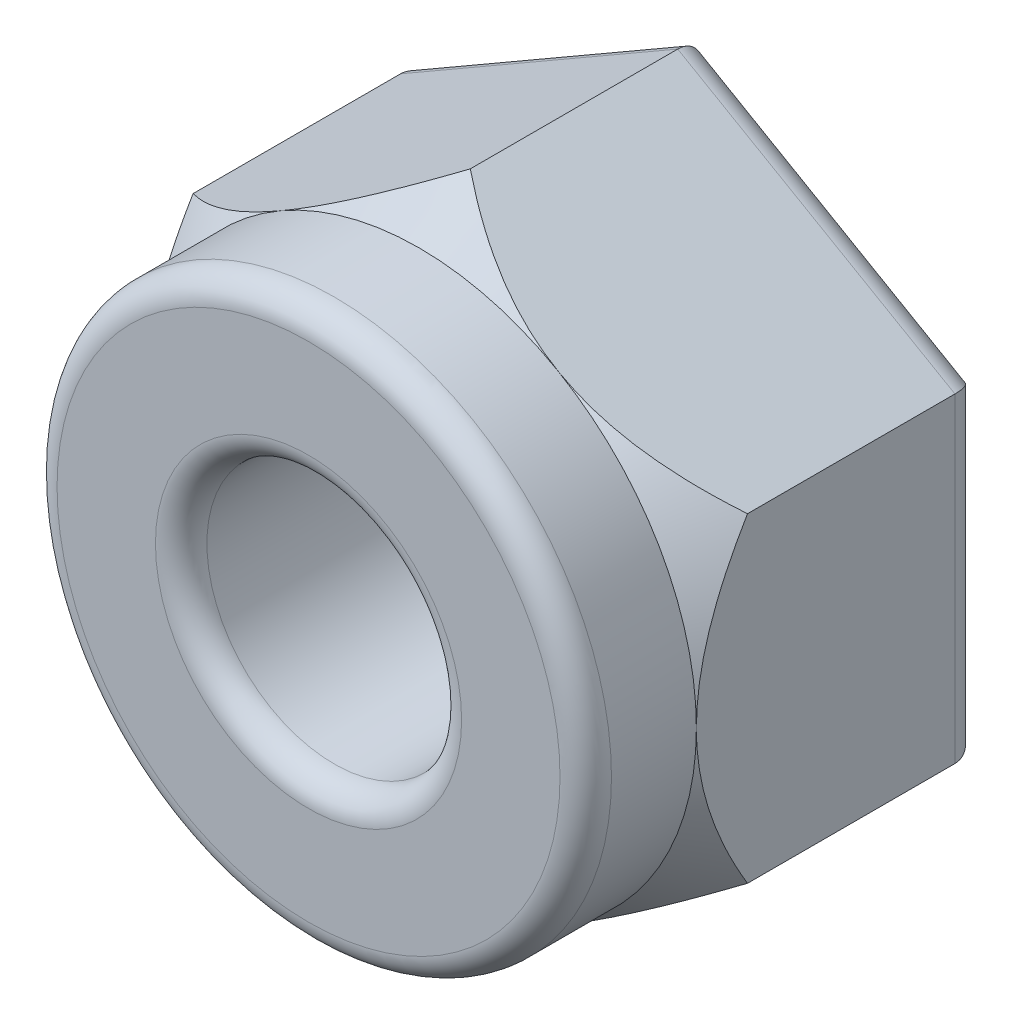
ISO-10303-21;
HEADER;
FILE_DESCRIPTION(('STEP AP214'),'2;1');
FILE_NAME('part.step','',(''),(''),'','','');
FILE_SCHEMA(('AUTOMOTIVE_DESIGN { 1 0 10303 214 1 1 1 1 }'));
ENDSEC;
DATA;
#1=APPLICATION_CONTEXT('core data for automotive mechanical design processes');
#2=APPLICATION_PROTOCOL_DEFINITION('international standard','automotive_design',2000,#1);
#3=PRODUCT_CONTEXT('',#1,'mechanical');
#4=PRODUCT('Part','Part','',(#3));
#5=PRODUCT_RELATED_PRODUCT_CATEGORY('part','',(#4));
#6=PRODUCT_DEFINITION_FORMATION('','',#4);
#7=PRODUCT_DEFINITION_CONTEXT('part definition',#1,'design');
#8=PRODUCT_DEFINITION('design','',#6,#7);
#9=PRODUCT_DEFINITION_SHAPE('','',#8);
#10=(LENGTH_UNIT() NAMED_UNIT(*) SI_UNIT(.MILLI.,.METRE.));
#11=(NAMED_UNIT(*) PLANE_ANGLE_UNIT() SI_UNIT($,.RADIAN.));
#12=(NAMED_UNIT(*) SI_UNIT($,.STERADIAN.) SOLID_ANGLE_UNIT());
#13=UNCERTAINTY_MEASURE_WITH_UNIT(LENGTH_MEASURE(1.E-05),#10,'distance_accuracy_value','');
#14=(GEOMETRIC_REPRESENTATION_CONTEXT(3) GLOBAL_UNCERTAINTY_ASSIGNED_CONTEXT((#13)) GLOBAL_UNIT_ASSIGNED_CONTEXT((#10,
#11,#12)) REPRESENTATION_CONTEXT('',''));
#15=CARTESIAN_POINT('',(0.,0.,0.));
#16=DIRECTION('',(0.,0.,1.));
#17=DIRECTION('',(1.,0.,0.));
#18=AXIS2_PLACEMENT_3D('',#15,#16,#17);
#19=CARTESIAN_POINT('',(0.,0.,7.7978));
#20=DIRECTION('',(0.,0.,-1.));
#21=DIRECTION('',(-1.,0.,0.));
#22=AXIS2_PLACEMENT_3D('',#19,#20,#21);
#23=CYLINDRICAL_SURFACE('',#22,5.473573);
#24=CARTESIAN_POINT('',(0.,0.,5.61340000007249));
#25=DIRECTION('',(0.,0.,-1.));
#26=DIRECTION('',(-1.,0.,0.));
#27=AXIS2_PLACEMENT_3D('',#24,#25,#26);
#28=CIRCLE('',#27,5.47357300007434);
#29=CARTESIAN_POINT('',(5.47363650003845,0.,5.61332432368251));
#30=VERTEX_POINT('',#29);
#31=CARTESIAN_POINT('',(-5.47363650003845,0.,5.61332432368251));
#32=VERTEX_POINT('',#31);
#33=EDGE_CURVE('E99',#30,#32,#28,.T.);
#34=ORIENTED_EDGE('',*,*,#33,.F.);
#35=CARTESIAN_POINT('',(0.,0.,5.61340000007249));
#36=DIRECTION('',(0.,0.,-1.));
#37=DIRECTION('',(-1.,0.,0.));
#38=AXIS2_PLACEMENT_3D('',#35,#36,#37);
#39=CIRCLE('',#38,5.47357300007434);
#40=EDGE_CURVE('E109',#32,#30,#39,.T.);
#41=ORIENTED_EDGE('',*,*,#40,.F.);
#42=EDGE_LOOP('',(#34,#41));
#43=FACE_BOUND('',#42,.T.);
#44=CARTESIAN_POINT('',(0.,0.,7.2898));
#45=DIRECTION('',(0.,0.,1.));
#46=DIRECTION('',(1.,0.,0.));
#47=AXIS2_PLACEMENT_3D('',#44,#45,#46);
#48=CIRCLE('',#47,5.473573);
#49=CARTESIAN_POINT('',(5.473573,0.,7.2898));
#50=VERTEX_POINT('',#49);
#51=EDGE_CURVE('E123',#50,#50,#48,.T.);
#52=ORIENTED_EDGE('',*,*,#51,.F.);
#53=EDGE_LOOP('',(#52));
#54=FACE_BOUND('',#53,.T.);
#55=ADVANCED_FACE('F18',(#43,#54),#23,.T.);
#56=CARTESIAN_POINT('',(0.,0.,7.2898));
#57=DIRECTION('',(0.,0.,1.));
#58=DIRECTION('',(1.,0.,0.));
#59=AXIS2_PLACEMENT_3D('',#56,#57,#58);
#60=TOROIDAL_SURFACE('',#59,4.965573,0.508);
#61=ORIENTED_EDGE('',*,*,#51,.T.);
#62=EDGE_LOOP('',(#61));
#63=FACE_BOUND('',#62,.T.);
#64=CARTESIAN_POINT('',(0.,0.,7.7978));
#65=DIRECTION('',(0.,0.,-1.));
#66=DIRECTION('',(1.,0.,0.));
#67=AXIS2_PLACEMENT_3D('',#64,#65,#66);
#68=CIRCLE('',#67,4.965573);
#69=CARTESIAN_POINT('',(-4.965573,0.,7.7978));
#70=VERTEX_POINT('',#69);
#71=CARTESIAN_POINT('',(4.965573,0.,7.7978));
#72=VERTEX_POINT('',#71);
#73=EDGE_CURVE('E279',#70,#72,#68,.F.);
#74=ORIENTED_EDGE('',*,*,#73,.F.);
#75=CARTESIAN_POINT('',(0.,0.,7.7978));
#76=DIRECTION('',(0.,0.,-1.));
#77=DIRECTION('',(-1.,0.,0.));
#78=AXIS2_PLACEMENT_3D('',#75,#76,#77);
#79=CIRCLE('',#78,4.965573);
#80=EDGE_CURVE('E120',#72,#70,#79,.F.);
#81=ORIENTED_EDGE('',*,*,#80,.F.);
#82=EDGE_LOOP('',(#74,#81));
#83=FACE_BOUND('',#82,.T.);
#84=ADVANCED_FACE('F162',(#63,#83),#60,.T.);
#85=CARTESIAN_POINT('',(0.,0.,4.59802658468789));
#86=DIRECTION('',(0.,0.,-1.));
#87=DIRECTION('',(-1.,0.,0.));
#88=AXIS2_PLACEMENT_3D('',#85,#86,#87);
#89=CONICAL_SURFACE('',#88,6.32557245836551,0.698131700784267);
#90=CARTESIAN_POINT('',(-3.44800650208801E-11,-6.32048433693605,4.6040903716672));
#91=CARTESIAN_POINT('',(0.0806468241206535,-6.27392287130734,4.65957169652409));
#92=CARTESIAN_POINT('',(0.161986378858017,-6.22696145748673,4.71370747096505));
#93=CARTESIAN_POINT('',(0.326198917475653,-6.13215330411363,4.81888767586166));
#94=CARTESIAN_POINT('',(0.40907260806246,-6.08430615654391,4.86993063287893));
#95=CARTESIAN_POINT('',(0.661110506350095,-5.93879200812046,5.0183362333634));
#96=CARTESIAN_POINT('',(0.832721574396692,-5.83971231178837,5.11029587753059));
#97=CARTESIAN_POINT('',(1.18325350039445,-5.6373326099544,5.27559122535804));
#98=CARTESIAN_POINT('',(1.36219491409555,-5.53402073658476,5.34886970733963));
#99=CARTESIAN_POINT('',(1.72592509487001,-5.32402101880213,5.47094506460906));
#100=CARTESIAN_POINT('',(1.91069662641023,-5.21734312532885,5.51980801191535));
#101=CARTESIAN_POINT('',(2.21651771158293,-5.04077723948054,5.57608542568136));
#102=CARTESIAN_POINT('',(2.33640110152782,-4.97156253202449,5.59210280181984));
#103=CARTESIAN_POINT('',(2.57697337158379,-4.83266806714811,5.61162851562283));
#104=CARTESIAN_POINT('',(2.69766238579003,-4.76298823230791,5.61513471603463));
#105=CARTESIAN_POINT('',(2.93815772938183,-4.62413818094633,5.60945527299954));
#106=CARTESIAN_POINT('',(3.05796530288268,-4.55496724613466,5.60033815603546));
#107=CARTESIAN_POINT('',(3.29640952776834,-4.41730140871021,5.56999209651926));
#108=CARTESIAN_POINT('',(3.41504612036376,-4.34880654003951,5.54876254897435));
#109=CARTESIAN_POINT('',(3.68316808018463,-4.19400625436128,5.48766703768943));
#110=CARTESIAN_POINT('',(3.83204787420965,-4.10805046520403,5.44425836539469));
#111=CARTESIAN_POINT('',(4.12572900443689,-3.93849358561143,5.34184078267169));
#112=CARTESIAN_POINT('',(4.27052806293275,-3.85489381021044,5.28282334367392));
#113=CARTESIAN_POINT('',(4.55624450695215,-3.68993534434394,5.15174656223514));
#114=CARTESIAN_POINT('',(4.69714394551453,-3.60858701556128,5.07963573854967));
#115=CARTESIAN_POINT('',(4.97453415362734,-3.44843570423678,4.92508691349547));
#116=CARTESIAN_POINT('',(5.1110263926622,-3.36963187328771,4.8426524000094));
#117=CARTESIAN_POINT('',(5.28390521141959,-3.26982024074095,4.73137215433213));
#118=CARTESIAN_POINT('',(5.32215338922578,-3.24773764498853,4.70630954535836));
#119=CARTESIAN_POINT('',(5.3982173986128,-3.20382206869329,4.65562586773433));
#120=CARTESIAN_POINT('',(5.4360341871267,-3.1819885356649,4.63000671451711));
#121=CARTESIAN_POINT('',(5.4737000000317,-3.16024216844496,4.60409037167073));
#122=B_SPLINE_CURVE_WITH_KNOTS('',3,(#90,#91,#92,#93,#94,#95,#96,#97,#98,#99,#100,#101,#102,
#103,#104,#105,#106,#107,#108,#109,#110,#111,#112,#113,#114,#115,#116,#117,#118,#119,#120,#121),
.UNSPECIFIED.,.F.,.F.,(4,2,2,2,2,2,2,2,2,2,2,2,2,2,2,4),(0.,0.32517094607764,0.650495607051777,
1.30506699828014,1.96161992758931,2.61638637340977,3.03393759262822,3.45156013765875,
3.86692445933383,4.28230952948092,4.81332314682153,5.34462750952096,5.87806799216359,
6.41132873445067,6.56366901387112,6.71554916045058),.UNSPECIFIED.);
#123=CARTESIAN_POINT('',(0.,-6.32048433694486,4.60409037167067));
#124=VERTEX_POINT('',#123);
#125=CARTESIAN_POINT('',(5.47370000001589,-3.16024216847243,4.60409037167067));
#126=VERTEX_POINT('',#125);
#127=EDGE_CURVE('E134',#124,#126,#122,.T.);
#128=ORIENTED_EDGE('',*,*,#127,.T.);
#129=CARTESIAN_POINT('',(5.47369999999103,-3.16024216849789,4.6040903716672));
#130=CARTESIAN_POINT('',(5.47369999999669,-3.06538820904934,4.66060246537327));
#131=CARTESIAN_POINT('',(5.47369999999909,-2.96970533686749,4.7157187156211));
#132=CARTESIAN_POINT('',(5.47370000000091,-2.7764965972506,4.82273768194899));
#133=CARTESIAN_POINT('',(5.47370000000032,-2.67896979302794,4.87463870401429));
#134=CARTESIAN_POINT('',(5.47369999999936,-2.38223854228141,5.02543743550952));
#135=CARTESIAN_POINT('',(5.47369999999983,-2.18009070238363,5.11869746994602));
#136=CARTESIAN_POINT('',(5.47370000000016,-1.77466064962528,5.28259710176229));
#137=CARTESIAN_POINT('',(5.47370000000004,-1.57164857729977,5.35389566962388));
#138=CARTESIAN_POINT('',(5.47369999999996,-1.15924602750321,5.47279373517426));
#139=CARTESIAN_POINT('',(5.47369999999999,-0.949877560536965,5.52046688631316));
#140=CARTESIAN_POINT('',(5.47370000000001,-0.616861951884045,5.57352537285922));
#141=CARTESIAN_POINT('',(5.4737,-0.494672423131132,5.58827341377343));
#142=CARTESIAN_POINT('',(5.4737,-0.248346070156859,5.60820858488308));
#143=CARTESIAN_POINT('',(5.4737,-0.124201793420817,5.61330305908261));
#144=CARTESIAN_POINT('',(5.4737,0.,5.61324864740481));
#145=B_SPLINE_CURVE_WITH_KNOTS('',3,(#129,#130,#131,#132,#133,#134,#135,#136,#137,#138,#139,
#140,#141,#142,#143,#144),.UNSPECIFIED.,.F.,.F.,(4,2,2,2,2,2,2,4),(0.,0.331212119006668,
0.662597285821446,1.32959639940192,1.97401235167945,2.61640646348871,2.98528256004872,
3.35768158224868),.UNSPECIFIED.);
#146=EDGE_CURVE('E128',#126,#30,#145,.T.);
#147=ORIENTED_EDGE('',*,*,#146,.T.);
#148=ORIENTED_EDGE('',*,*,#33,.T.);
#149=CARTESIAN_POINT('',(-5.4737,0.,5.61324864740481));
#150=CARTESIAN_POINT('',(-5.4737,-0.0715756577425598,5.61325372616311));
#151=CARTESIAN_POINT('',(-5.4737,-0.143140391499476,5.61157473093531));
#152=CARTESIAN_POINT('',(-5.4737,-0.286104737437581,5.60489744786615));
#153=CARTESIAN_POINT('',(-5.4737,-0.357504372113359,5.59989964265952));
#154=CARTESIAN_POINT('',(-5.4737,-0.570990036034535,5.58002678017663));
#155=CARTESIAN_POINT('',(-5.4737,-0.712647081285898,5.5602718859225));
#156=CARTESIAN_POINT('',(-5.4737,-0.991189854919164,5.50915500612715));
#157=CARTESIAN_POINT('',(-5.4737,-1.12811562886177,5.47800594297026));
#158=CARTESIAN_POINT('',(-5.4737,-1.39921221294859,5.40533316321875));
#159=CARTESIAN_POINT('',(-5.4737,-1.53338204703063,5.36380583728373));
#160=CARTESIAN_POINT('',(-5.4737,-1.79540860286679,5.27288343635352));
#161=CARTESIAN_POINT('',(-5.4737,-1.92333956982938,5.22370002426318));
#162=CARTESIAN_POINT('',(-5.4737,-2.17615622936337,5.11803896903137));
#163=CARTESIAN_POINT('',(-5.4737,-2.3010414261266,5.06156014759897));
#164=CARTESIAN_POINT('',(-5.4737,-2.55009716634746,4.94136191805613));
#165=CARTESIAN_POINT('',(-5.4737,-2.67421211736171,4.87752824760918));
#166=CARTESIAN_POINT('',(-5.4737,-2.91941495123158,4.74455138277509));
#167=CARTESIAN_POINT('',(-5.4737,-3.04050568272448,4.67541345558568));
#168=CARTESIAN_POINT('',(-5.4737,-3.16024216849924,4.6040903716711));
#169=B_SPLINE_CURVE_WITH_KNOTS('',3,(#149,#150,#151,#152,#153,#154,#155,#156,#157,#158,#159,
#160,#161,#162,#163,#164,#165,#166,#167,#168),.UNSPECIFIED.,.F.,.F.,(4,2,2,2,2,2,2,2,2,4),(0.,
0.214686292298542,0.429341370886519,0.857802067618737,1.2786341794342,1.69961285192831,
2.11053428403396,2.52152216776784,2.94008473325169,3.35823691037953),.UNSPECIFIED.);
#170=CARTESIAN_POINT('',(-5.47370000001589,-3.16024216847243,4.60409037167067));
#171=VERTEX_POINT('',#170);
#172=EDGE_CURVE('E182',#32,#171,#169,.T.);
#173=ORIENTED_EDGE('',*,*,#172,.T.);
#174=CARTESIAN_POINT('',(-5.47370000002551,-3.16024216843816,4.6040903716672));
#175=CARTESIAN_POINT('',(-5.39305317587604,-3.20680363407669,4.65957169652409));
#176=CARTESIAN_POINT('',(-5.31171362114108,-3.25376504790146,4.71370747096505));
#177=CARTESIAN_POINT('',(-5.14750108252526,-3.34857320127771,4.81888767586166));
#178=CARTESIAN_POINT('',(-5.06462739193786,-3.3964203488464,4.86993063287893));
#179=CARTESIAN_POINT('',(-4.81258949364927,-3.5419344972682,5.0183362333634));
#180=CARTESIAN_POINT('',(-4.64097842560314,-3.64101419360109,5.11029587753059));
#181=CARTESIAN_POINT('',(-4.29044649960572,-3.84339389543566,5.27559122535804));
#182=CARTESIAN_POINT('',(-4.1115050859045,-3.94670576880508,5.34886970733963));
#183=CARTESIAN_POINT('',(-3.74777490512995,-4.15670548658756,5.47094506460906));
#184=CARTESIAN_POINT('',(-3.56300337358976,-4.2633833800609,5.51980801191536));
#185=CARTESIAN_POINT('',(-3.25718228841708,-4.43994926590924,5.57608542568136));
#186=CARTESIAN_POINT('',(-3.13729889847218,-4.50916397336528,5.59210280181984));
#187=CARTESIAN_POINT('',(-2.89672662841621,-4.64805843824165,5.61162851562283));
#188=CARTESIAN_POINT('',(-2.77603761420997,-4.71773827308186,5.61513471603463));
#189=CARTESIAN_POINT('',(-2.53554227061817,-4.85658832444343,5.60945527299954));
#190=CARTESIAN_POINT('',(-2.41573469711732,-4.9257592592551,5.60033815603546));
#191=CARTESIAN_POINT('',(-2.17729047223166,-5.06342509667955,5.56999209651927));
#192=CARTESIAN_POINT('',(-2.05865387963624,-5.13191996535026,5.54876254897436));
#193=CARTESIAN_POINT('',(-1.79053191981537,-5.28672025102849,5.48766703768943));
#194=CARTESIAN_POINT('',(-1.64165212579035,-5.37267604018573,5.44425836539469));
#195=CARTESIAN_POINT('',(-1.34797099556312,-5.54223291977834,5.34184078267169));
#196=CARTESIAN_POINT('',(-1.20317193706725,-5.62583269517933,5.28282334367392));
#197=CARTESIAN_POINT('',(-0.917455493047856,-5.79079116104583,5.15174656223514));
#198=CARTESIAN_POINT('',(-0.776556054485472,-5.87213948982849,5.07963573854967));
#199=CARTESIAN_POINT('',(-0.499165846372664,-6.03229080115298,4.92508691349547));
#200=CARTESIAN_POINT('',(-0.362673607337806,-6.11109463210205,4.8426524000094));
#201=CARTESIAN_POINT('',(-0.189794788580416,-6.21090626464882,4.73137215433213));
#202=CARTESIAN_POINT('',(-0.151546610774223,-6.23298886040124,4.70630954535836));
#203=CARTESIAN_POINT('',(-0.075482601387203,-6.27690443669647,4.65562586773433));
#204=CARTESIAN_POINT('',(-0.037665812873302,-6.29873796972486,4.63000671451711));
#205=CARTESIAN_POINT('',(3.17006054055008E-11,-6.32048433694481,4.60409037167073));
#206=B_SPLINE_CURVE_WITH_KNOTS('',3,(#174,#175,#176,#177,#178,#179,#180,#181,#182,#183,#184,
#185,#186,#187,#188,#189,#190,#191,#192,#193,#194,#195,#196,#197,#198,#199,#200,#201,#202,#203,
#204,#205),.UNSPECIFIED.,.F.,.F.,(4,2,2,2,2,2,2,2,2,2,2,2,2,2,2,4),(0.,0.32517094607764,
0.650495607051778,1.30506699828014,1.96161992758932,2.61638637340977,3.03393759262822,
3.45156013765875,3.86692445933383,4.28230952948092,4.81332314682153,5.34462750952096,
5.87806799216359,6.41132873445067,6.56366901387112,6.71554916045059),.UNSPECIFIED.);
#207=EDGE_CURVE('E91',#171,#124,#206,.T.);
#208=ORIENTED_EDGE('',*,*,#207,.T.);
#209=EDGE_LOOP('',(#128,#147,#148,#173,#208));
#210=FACE_BOUND('',#209,.T.);
#211=ADVANCED_FACE('F133',(#210),#89,.T.);
#212=CARTESIAN_POINT('',(0.,0.,4.59802658468789));
#213=DIRECTION('',(0.,0.,-1.));
#214=DIRECTION('',(-1.,0.,0.));
#215=AXIS2_PLACEMENT_3D('',#212,#213,#214);
#216=CONICAL_SURFACE('',#215,6.32557245836551,0.698131700784267);
#217=CARTESIAN_POINT('',(3.44816804891494E-11,6.32048433693605,4.6040903716672));
#218=CARTESIAN_POINT('',(-0.080646824120652,6.27392287130734,4.65957169652409));
#219=CARTESIAN_POINT('',(-0.161986378858016,6.22696145748673,4.71370747096505));
#220=CARTESIAN_POINT('',(-0.326198917475652,6.13215330411363,4.81888767586166));
#221=CARTESIAN_POINT('',(-0.409072608062459,6.08430615654391,4.86993063287893));
#222=CARTESIAN_POINT('',(-0.661110506350094,5.93879200812046,5.0183362333634));
#223=CARTESIAN_POINT('',(-0.832721574396691,5.83971231178837,5.11029587753059));
#224=CARTESIAN_POINT('',(-1.18325350039445,5.6373326099544,5.27559122535804));
#225=CARTESIAN_POINT('',(-1.36219491409555,5.53402073658476,5.34886970733963));
#226=CARTESIAN_POINT('',(-1.72592509487,5.32402101880213,5.47094506460906));
#227=CARTESIAN_POINT('',(-1.91069662641023,5.21734312532885,5.51980801191535));
#228=CARTESIAN_POINT('',(-2.21651771158293,5.04077723948054,5.57608542568136));
#229=CARTESIAN_POINT('',(-2.33640110152782,4.97156253202449,5.59210280181984));
#230=CARTESIAN_POINT('',(-2.57697337158379,4.83266806714811,5.61162851562283));
#231=CARTESIAN_POINT('',(-2.69766238579003,4.76298823230791,5.61513471603463));
#232=CARTESIAN_POINT('',(-2.93815772938183,4.62413818094633,5.60945527299954));
#233=CARTESIAN_POINT('',(-3.05796530288268,4.55496724613466,5.60033815603546));
#234=CARTESIAN_POINT('',(-3.29640952776834,4.41730140871021,5.56999209651927));
#235=CARTESIAN_POINT('',(-3.41504612036376,4.34880654003951,5.54876254897436));
#236=CARTESIAN_POINT('',(-3.68316808018463,4.19400625436128,5.48766703768943));
#237=CARTESIAN_POINT('',(-3.83204787420965,4.10805046520403,5.44425836539469));
#238=CARTESIAN_POINT('',(-4.12572900443688,3.93849358561143,5.34184078267169));
#239=CARTESIAN_POINT('',(-4.27052806293275,3.85489381021044,5.28282334367392));
#240=CARTESIAN_POINT('',(-4.55624450695214,3.68993534434394,5.15174656223514));
#241=CARTESIAN_POINT('',(-4.69714394551453,3.60858701556128,5.07963573854967));
#242=CARTESIAN_POINT('',(-4.97453415362734,3.44843570423678,4.92508691349547));
#243=CARTESIAN_POINT('',(-5.11102639266219,3.36963187328771,4.8426524000094));
#244=CARTESIAN_POINT('',(-5.28390521141958,3.26982024074095,4.73137215433213));
#245=CARTESIAN_POINT('',(-5.32215338922578,3.24773764498853,4.70630954535836));
#246=CARTESIAN_POINT('',(-5.3982173986128,3.20382206869329,4.65562586773433));
#247=CARTESIAN_POINT('',(-5.4360341871267,3.1819885356649,4.63000671451711));
#248=CARTESIAN_POINT('',(-5.4737000000317,3.16024216844495,4.60409037167073));
#249=B_SPLINE_CURVE_WITH_KNOTS('',3,(#217,#218,#219,#220,#221,#222,#223,#224,#225,#226,#227,
#228,#229,#230,#231,#232,#233,#234,#235,#236,#237,#238,#239,#240,#241,#242,#243,#244,#245,#246,
#247,#248),.UNSPECIFIED.,.F.,.F.,(4,2,2,2,2,2,2,2,2,2,2,2,2,2,2,4),(0.,0.32517094607764,
0.650495607051777,1.30506699828014,1.96161992758931,2.61638637340977,3.03393759262822,
3.45156013765875,3.86692445933383,4.28230952948092,4.81332314682153,5.34462750952096,
5.87806799216359,6.41132873445067,6.56366901387112,6.71554916045058),.UNSPECIFIED.);
#250=CARTESIAN_POINT('',(0.,6.32048433694486,4.60409037167067));
#251=VERTEX_POINT('',#250);
#252=CARTESIAN_POINT('',(-5.4737,3.16024216848161,4.6040903716816));
#253=VERTEX_POINT('',#252);
#254=EDGE_CURVE('E239',#251,#253,#249,.T.);
#255=ORIENTED_EDGE('',*,*,#254,.T.);
#256=CARTESIAN_POINT('',(-5.47369999999102,3.16024216849789,4.6040903716672));
#257=CARTESIAN_POINT('',(-5.47369999999669,3.06538820904934,4.66060246537327));
#258=CARTESIAN_POINT('',(-5.47369999999909,2.9697053368675,4.7157187156211));
#259=CARTESIAN_POINT('',(-5.47370000000091,2.7764965972506,4.82273768194899));
#260=CARTESIAN_POINT('',(-5.47370000000032,2.67896979302794,4.87463870401429));
#261=CARTESIAN_POINT('',(-5.47369999999936,2.38223854228141,5.02543743550952));
#262=CARTESIAN_POINT('',(-5.47369999999983,2.18009070238363,5.11869746994602));
#263=CARTESIAN_POINT('',(-5.47370000000016,1.77466064962528,5.28259710176229));
#264=CARTESIAN_POINT('',(-5.47370000000004,1.57164857729977,5.35389566962388));
#265=CARTESIAN_POINT('',(-5.47369999999996,1.15924602750321,5.47279373517426));
#266=CARTESIAN_POINT('',(-5.47369999999999,0.949877560536967,5.52046688631316));
#267=CARTESIAN_POINT('',(-5.47370000000001,0.616861951884046,5.57352537285922));
#268=CARTESIAN_POINT('',(-5.4737,0.494672423131133,5.58827341377343));
#269=CARTESIAN_POINT('',(-5.4737,0.24834607015686,5.60820858488308));
#270=CARTESIAN_POINT('',(-5.4737,0.124201793420818,5.61330305908261));
#271=CARTESIAN_POINT('',(-5.4737,0.,5.61324864740481));
#272=B_SPLINE_CURVE_WITH_KNOTS('',3,(#256,#257,#258,#259,#260,#261,#262,#263,#264,#265,#266,
#267,#268,#269,#270,#271),.UNSPECIFIED.,.F.,.F.,(4,2,2,2,2,2,2,4),(0.,0.331212119006667,
0.662597285821447,1.32959639940192,1.97401235167945,2.61640646348871,2.98528256004872,
3.35768158224869),.UNSPECIFIED.);
#273=EDGE_CURVE('E117',#253,#32,#272,.T.);
#274=ORIENTED_EDGE('',*,*,#273,.T.);
#275=ORIENTED_EDGE('',*,*,#40,.T.);
#276=CARTESIAN_POINT('',(5.4737,0.,5.61324864740481));
#277=CARTESIAN_POINT('',(5.4737,0.0715756577425604,5.61325372616311));
#278=CARTESIAN_POINT('',(5.4737,0.143140391499476,5.61157473093531));
#279=CARTESIAN_POINT('',(5.4737,0.286104737437581,5.60489744786616));
#280=CARTESIAN_POINT('',(5.4737,0.35750437211336,5.59989964265952));
#281=CARTESIAN_POINT('',(5.4737,0.570990036034535,5.58002678017663));
#282=CARTESIAN_POINT('',(5.4737,0.712647081285898,5.5602718859225));
#283=CARTESIAN_POINT('',(5.4737,0.991189854919165,5.50915500612715));
#284=CARTESIAN_POINT('',(5.4737,1.12811562886177,5.47800594297026));
#285=CARTESIAN_POINT('',(5.4737,1.39921221294859,5.40533316321875));
#286=CARTESIAN_POINT('',(5.4737,1.53338204703063,5.36380583728373));
#287=CARTESIAN_POINT('',(5.4737,1.79540860286679,5.27288343635352));
#288=CARTESIAN_POINT('',(5.4737,1.92333956982938,5.22370002426318));
#289=CARTESIAN_POINT('',(5.4737,2.17615622936337,5.11803896903138));
#290=CARTESIAN_POINT('',(5.4737,2.3010414261266,5.06156014759897));
#291=CARTESIAN_POINT('',(5.4737,2.55009716634746,4.94136191805613));
#292=CARTESIAN_POINT('',(5.4737,2.67421211736171,4.87752824760918));
#293=CARTESIAN_POINT('',(5.4737,2.91941495123158,4.74455138277509));
#294=CARTESIAN_POINT('',(5.4737,3.04050568272448,4.67541345558568));
#295=CARTESIAN_POINT('',(5.4737,3.16024216849924,4.6040903716711));
#296=B_SPLINE_CURVE_WITH_KNOTS('',3,(#276,#277,#278,#279,#280,#281,#282,#283,#284,#285,#286,
#287,#288,#289,#290,#291,#292,#293,#294,#295),.UNSPECIFIED.,.F.,.F.,(4,2,2,2,2,2,2,2,2,4),(0.,
0.214686292298542,0.429341370886519,0.857802067618737,1.2786341794342,1.69961285192831,
2.11053428403396,2.52152216776784,2.94008473325169,3.35823691037953),.UNSPECIFIED.);
#297=CARTESIAN_POINT('',(5.47370000001589,3.16024216847243,4.60409037167067));
#298=VERTEX_POINT('',#297);
#299=EDGE_CURVE('E114',#30,#298,#296,.T.);
#300=ORIENTED_EDGE('',*,*,#299,.T.);
#301=CARTESIAN_POINT('',(5.47370000002551,3.16024216843816,4.6040903716672));
#302=CARTESIAN_POINT('',(5.39305317587604,3.20680363407669,4.65957169652409));
#303=CARTESIAN_POINT('',(5.31171362114108,3.25376504790146,4.71370747096505));
#304=CARTESIAN_POINT('',(5.14750108252526,3.34857320127771,4.81888767586166));
#305=CARTESIAN_POINT('',(5.06462739193786,3.3964203488464,4.86993063287893));
#306=CARTESIAN_POINT('',(4.81258949364927,3.5419344972682,5.0183362333634));
#307=CARTESIAN_POINT('',(4.64097842560314,3.64101419360109,5.11029587753059));
#308=CARTESIAN_POINT('',(4.29044649960572,3.84339389543566,5.27559122535804));
#309=CARTESIAN_POINT('',(4.1115050859045,3.94670576880508,5.34886970733963));
#310=CARTESIAN_POINT('',(3.74777490512995,4.15670548658755,5.47094506460906));
#311=CARTESIAN_POINT('',(3.56300337358977,4.2633833800609,5.51980801191536));
#312=CARTESIAN_POINT('',(3.25718228841708,4.43994926590923,5.57608542568136));
#313=CARTESIAN_POINT('',(3.13729889847218,4.50916397336528,5.59210280181984));
#314=CARTESIAN_POINT('',(2.89672662841621,4.64805843824165,5.61162851562283));
#315=CARTESIAN_POINT('',(2.77603761420997,4.71773827308186,5.61513471603463));
#316=CARTESIAN_POINT('',(2.53554227061818,4.85658832444343,5.60945527299954));
#317=CARTESIAN_POINT('',(2.41573469711732,4.9257592592551,5.60033815603546));
#318=CARTESIAN_POINT('',(2.17729047223166,5.06342509667955,5.56999209651927));
#319=CARTESIAN_POINT('',(2.05865387963624,5.13191996535026,5.54876254897436));
#320=CARTESIAN_POINT('',(1.79053191981537,5.28672025102848,5.48766703768943));
#321=CARTESIAN_POINT('',(1.64165212579035,5.37267604018573,5.4442583653947));
#322=CARTESIAN_POINT('',(1.34797099556312,5.54223291977833,5.34184078267169));
#323=CARTESIAN_POINT('',(1.20317193706725,5.62583269517933,5.28282334367393));
#324=CARTESIAN_POINT('',(0.917455493047858,5.79079116104583,5.15174656223514));
#325=CARTESIAN_POINT('',(0.776556054485475,5.87213948982849,5.07963573854968));
#326=CARTESIAN_POINT('',(0.499165846372667,6.03229080115298,4.92508691349547));
#327=CARTESIAN_POINT('',(0.362673607337809,6.11109463210205,4.84265240000941));
#328=CARTESIAN_POINT('',(0.189794788580419,6.21090626464882,4.73137215433214));
#329=CARTESIAN_POINT('',(0.151546610774225,6.23298886040123,4.70630954535836));
#330=CARTESIAN_POINT('',(0.0754826013872043,6.27690443669647,4.65562586773433));
#331=CARTESIAN_POINT('',(0.0376658128733034,6.29873796972486,4.63000671451712));
#332=CARTESIAN_POINT('',(-3.16995613420607E-11,6.32048433694481,4.60409037167073));
#333=B_SPLINE_CURVE_WITH_KNOTS('',3,(#301,#302,#303,#304,#305,#306,#307,#308,#309,#310,#311,
#312,#313,#314,#315,#316,#317,#318,#319,#320,#321,#322,#323,#324,#325,#326,#327,#328,#329,#330,
#331,#332),.UNSPECIFIED.,.F.,.F.,(4,2,2,2,2,2,2,2,2,2,2,2,2,2,2,4),(0.,0.32517094607764,
0.650495607051779,1.30506699828014,1.96161992758932,2.61638637340977,3.03393759262822,
3.45156013765875,3.86692445933383,4.28230952948092,4.81332314682153,5.34462750952096,
5.87806799216359,6.41132873445067,6.56366901387112,6.71554916045058),.UNSPECIFIED.);
#334=EDGE_CURVE('E241',#298,#251,#333,.T.);
#335=ORIENTED_EDGE('',*,*,#334,.T.);
#336=EDGE_LOOP('',(#255,#274,#275,#300,#335));
#337=FACE_BOUND('',#336,.T.);
#338=ADVANCED_FACE('F111',(#337),#216,.T.);
#339=CARTESIAN_POINT('',(0.,0.,7.7978));
#340=DIRECTION('',(0.,0.,1.));
#341=DIRECTION('',(1.,0.,0.));
#342=AXIS2_PLACEMENT_3D('',#339,#340,#341);
#343=PLANE('',#342);
#344=ORIENTED_EDGE('',*,*,#80,.T.);
#345=ORIENTED_EDGE('',*,*,#73,.T.);
#346=EDGE_LOOP('',(#344,#345));
#347=FACE_BOUND('',#346,.T.);
#348=CARTESIAN_POINT('',(0.,0.,7.7978));
#349=DIRECTION('',(0.,0.,1.));
#350=DIRECTION('',(-1.,0.,0.));
#351=AXIS2_PLACEMENT_3D('',#348,#349,#350);
#352=CIRCLE('',#351,3.0226);
#353=CARTESIAN_POINT('',(-3.0226,0.,7.7978));
#354=VERTEX_POINT('',#353);
#355=CARTESIAN_POINT('',(3.0226,0.,7.7978));
#356=VERTEX_POINT('',#355);
#357=EDGE_CURVE('E204',#354,#356,#352,.T.);
#358=ORIENTED_EDGE('',*,*,#357,.F.);
#359=CARTESIAN_POINT('',(0.,0.,7.7978));
#360=DIRECTION('',(0.,0.,1.));
#361=DIRECTION('',(1.,0.,0.));
#362=AXIS2_PLACEMENT_3D('',#359,#360,#361);
#363=CIRCLE('',#362,3.0226);
#364=EDGE_CURVE('E257',#356,#354,#363,.T.);
#365=ORIENTED_EDGE('',*,*,#364,.F.);
#366=EDGE_LOOP('',(#358,#365));
#367=FACE_BOUND('',#366,.T.);
#368=ADVANCED_FACE('F188',(#347,#367),#343,.T.);
#369=CARTESIAN_POINT('',(-5.4737,3.16024216846326,5.6134));
#370=DIRECTION('',(1.,0.,0.));
#371=DIRECTION('',(0.,1.,0.));
#372=AXIS2_PLACEMENT_3D('',#369,#370,#371);
#373=PLANE('',#372);
#374=DIRECTION('',(0.,-1.,0.));
#375=VECTOR('',#374,1.);
#376=CARTESIAN_POINT('',(-5.4737,3.16024216846326,0.508000000000001));
#377=LINE('',#376,#375);
#378=CARTESIAN_POINT('',(-5.4737,-3.16024216846325,0.508));
#379=VERTEX_POINT('',#378);
#380=CARTESIAN_POINT('',(-5.4737,3.16024216846326,0.508));
#381=VERTEX_POINT('',#380);
#382=EDGE_CURVE('E330',#379,#381,#377,.F.);
#383=ORIENTED_EDGE('',*,*,#382,.F.);
#384=DIRECTION('',(0.,0.,1.));
#385=VECTOR('',#384,1.);
#386=CARTESIAN_POINT('',(-5.4737,-3.16024216846325,5.6134));
#387=LINE('',#386,#385);
#388=EDGE_CURVE('E243',#379,#171,#387,.T.);
#389=ORIENTED_EDGE('',*,*,#388,.T.);
#390=ORIENTED_EDGE('',*,*,#172,.F.);
#391=ORIENTED_EDGE('',*,*,#273,.F.);
#392=DIRECTION('',(0.,0.,1.));
#393=VECTOR('',#392,1.);
#394=CARTESIAN_POINT('',(-5.4737,3.16024216846326,5.6134));
#395=LINE('',#394,#393);
#396=EDGE_CURVE('E236',#253,#381,#395,.F.);
#397=ORIENTED_EDGE('',*,*,#396,.T.);
#398=EDGE_LOOP('',(#383,#389,#390,#391,#397));
#399=FACE_BOUND('',#398,.T.);
#400=ADVANCED_FACE('F184',(#399),#373,.F.);
#401=CARTESIAN_POINT('',(-5.4737,-3.16024216846325,5.6134));
#402=DIRECTION('',(0.5,0.866025403784439,0.));
#403=DIRECTION('',(-0.866025403784439,0.5,0.));
#404=AXIS2_PLACEMENT_3D('',#401,#402,#403);
#405=PLANE('',#404);
#406=DIRECTION('',(0.866025403784439,-0.5,0.));
#407=VECTOR('',#406,1.);
#408=CARTESIAN_POINT('',(-5.4737,-3.16024216846325,0.508000000000001));
#409=LINE('',#408,#407);
#410=CARTESIAN_POINT('',(0.,-6.32048433692651,0.508));
#411=VERTEX_POINT('',#410);
#412=EDGE_CURVE('E327',#411,#379,#409,.F.);
#413=ORIENTED_EDGE('',*,*,#412,.F.);
#414=DIRECTION('',(0.,0.,1.));
#415=VECTOR('',#414,1.);
#416=CARTESIAN_POINT('',(0.,-6.32048433692651,5.6134));
#417=LINE('',#416,#415);
#418=EDGE_CURVE('E136',#411,#124,#417,.T.);
#419=ORIENTED_EDGE('',*,*,#418,.T.);
#420=ORIENTED_EDGE('',*,*,#207,.F.);
#421=ORIENTED_EDGE('',*,*,#388,.F.);
#422=EDGE_LOOP('',(#413,#419,#420,#421));
#423=FACE_BOUND('',#422,.T.);
#424=ADVANCED_FACE('F187',(#423),#405,.F.);
#425=CARTESIAN_POINT('',(0.,-6.32048433692651,5.6134));
#426=DIRECTION('',(-0.5,0.866025403784439,0.));
#427=DIRECTION('',(-0.866025403784439,-0.5,0.));
#428=AXIS2_PLACEMENT_3D('',#425,#426,#427);
#429=PLANE('',#428);
#430=DIRECTION('',(0.866025403784439,0.5,0.));
#431=VECTOR('',#430,1.);
#432=CARTESIAN_POINT('',(0.,-6.32048433692651,0.508000000000001));
#433=LINE('',#432,#431);
#434=CARTESIAN_POINT('',(5.4737,-3.16024216846326,0.508000000000001));
#435=VERTEX_POINT('',#434);
#436=EDGE_CURVE('E324',#435,#411,#433,.F.);
#437=ORIENTED_EDGE('',*,*,#436,.F.);
#438=DIRECTION('',(0.,0.,1.));
#439=VECTOR('',#438,1.);
#440=CARTESIAN_POINT('',(5.4737,-3.16024216846326,5.6134));
#441=LINE('',#440,#439);
#442=EDGE_CURVE('E131',#435,#126,#441,.T.);
#443=ORIENTED_EDGE('',*,*,#442,.T.);
#444=ORIENTED_EDGE('',*,*,#127,.F.);
#445=ORIENTED_EDGE('',*,*,#418,.F.);
#446=EDGE_LOOP('',(#437,#443,#444,#445));
#447=FACE_BOUND('',#446,.T.);
#448=ADVANCED_FACE('F348',(#447),#429,.F.);
#449=CARTESIAN_POINT('',(5.4737,-3.16024216846326,5.6134));
#450=DIRECTION('',(-1.,0.,0.));
#451=DIRECTION('',(0.,-1.,0.));
#452=AXIS2_PLACEMENT_3D('',#449,#450,#451);
#453=PLANE('',#452);
#454=DIRECTION('',(0.,1.,0.));
#455=VECTOR('',#454,1.);
#456=CARTESIAN_POINT('',(5.4737,-3.16024216846326,0.508000000000001));
#457=LINE('',#456,#455);
#458=CARTESIAN_POINT('',(5.4737,3.16024216846325,0.508));
#459=VERTEX_POINT('',#458);
#460=EDGE_CURVE('E321',#459,#435,#457,.F.);
#461=ORIENTED_EDGE('',*,*,#460,.F.);
#462=DIRECTION('',(0.,0.,1.));
#463=VECTOR('',#462,1.);
#464=CARTESIAN_POINT('',(5.4737,3.16024216846325,5.6134));
#465=LINE('',#464,#463);
#466=EDGE_CURVE('E130',#459,#298,#465,.T.);
#467=ORIENTED_EDGE('',*,*,#466,.T.);
#468=ORIENTED_EDGE('',*,*,#299,.F.);
#469=ORIENTED_EDGE('',*,*,#146,.F.);
#470=ORIENTED_EDGE('',*,*,#442,.F.);
#471=EDGE_LOOP('',(#461,#467,#468,#469,#470));
#472=FACE_BOUND('',#471,.T.);
#473=ADVANCED_FACE('F127',(#472),#453,.F.);
#474=CARTESIAN_POINT('',(5.4737,3.16024216846325,5.6134));
#475=DIRECTION('',(-0.5,-0.866025403784439,0.));
#476=DIRECTION('',(0.866025403784439,-0.5,0.));
#477=AXIS2_PLACEMENT_3D('',#474,#475,#476);
#478=PLANE('',#477);
#479=DIRECTION('',(-0.866025403784439,0.5,0.));
#480=VECTOR('',#479,1.);
#481=CARTESIAN_POINT('',(5.4737,3.16024216846325,0.508000000000001));
#482=LINE('',#481,#480);
#483=CARTESIAN_POINT('',(0.,6.32048433692651,0.508));
#484=VERTEX_POINT('',#483);
#485=EDGE_CURVE('E318',#484,#459,#482,.F.);
#486=ORIENTED_EDGE('',*,*,#485,.F.);
#487=DIRECTION('',(0.,0.,1.));
#488=VECTOR('',#487,1.);
#489=CARTESIAN_POINT('',(0.,6.32048433692651,5.6134));
#490=LINE('',#489,#488);
#491=EDGE_CURVE('E233',#484,#251,#490,.T.);
#492=ORIENTED_EDGE('',*,*,#491,.T.);
#493=ORIENTED_EDGE('',*,*,#334,.F.);
#494=ORIENTED_EDGE('',*,*,#466,.F.);
#495=EDGE_LOOP('',(#486,#492,#493,#494));
#496=FACE_BOUND('',#495,.T.);
#497=ADVANCED_FACE('F338',(#496),#478,.F.);
#498=CARTESIAN_POINT('',(0.,6.32048433692651,5.6134));
#499=DIRECTION('',(0.5,-0.866025403784439,0.));
#500=DIRECTION('',(0.866025403784439,0.5,0.));
#501=AXIS2_PLACEMENT_3D('',#498,#499,#500);
#502=PLANE('',#501);
#503=DIRECTION('',(-0.866025403784439,-0.5,0.));
#504=VECTOR('',#503,1.);
#505=CARTESIAN_POINT('',(0.,6.32048433692651,0.508000000000001));
#506=LINE('',#505,#504);
#507=EDGE_CURVE('E314',#381,#484,#506,.F.);
#508=ORIENTED_EDGE('',*,*,#507,.F.);
#509=ORIENTED_EDGE('',*,*,#396,.F.);
#510=ORIENTED_EDGE('',*,*,#254,.F.);
#511=ORIENTED_EDGE('',*,*,#491,.F.);
#512=EDGE_LOOP('',(#508,#509,#510,#511));
#513=FACE_BOUND('',#512,.T.);
#514=ADVANCED_FACE('F222',(#513),#502,.F.);
#515=CARTESIAN_POINT('',(0.,0.,7.2898));
#516=DIRECTION('',(0.,0.,1.));
#517=DIRECTION('',(1.,0.,0.));
#518=AXIS2_PLACEMENT_3D('',#515,#516,#517);
#519=TOROIDAL_SURFACE('',#518,3.0226,0.508);
#520=CARTESIAN_POINT('',(0.,0.,7.2898));
#521=DIRECTION('',(0.,0.,1.));
#522=DIRECTION('',(1.,0.,0.));
#523=AXIS2_PLACEMENT_3D('',#520,#521,#522);
#524=CIRCLE('',#523,2.5146);
#525=CARTESIAN_POINT('',(2.5146,0.,7.2898));
#526=VERTEX_POINT('',#525);
#527=EDGE_CURVE('E231',#526,#526,#524,.F.);
#528=ORIENTED_EDGE('',*,*,#527,.T.);
#529=EDGE_LOOP('',(#528));
#530=FACE_BOUND('',#529,.T.);
#531=ORIENTED_EDGE('',*,*,#364,.T.);
#532=ORIENTED_EDGE('',*,*,#357,.T.);
#533=EDGE_LOOP('',(#531,#532));
#534=FACE_BOUND('',#533,.T.);
#535=ADVANCED_FACE('F210',(#530,#534),#519,.T.);
#536=CARTESIAN_POINT('',(-4.9657,3.16024216846326,0.508));
#537=DIRECTION('',(0.,-1.,0.));
#538=DIRECTION('',(1.,0.,0.));
#539=AXIS2_PLACEMENT_3D('',#536,#537,#538);
#540=CYLINDRICAL_SURFACE('',#539,0.508);
#541=CARTESIAN_POINT('',(-4.9657,2.86694823171493,0.508));
#542=DIRECTION('',(-0.5,-0.866025403784439,0.));
#543=DIRECTION('',(-0.866025403784439,0.5,0.));
#544=AXIS2_PLACEMENT_3D('',#541,#542,#543);
#545=ELLIPSE('',#544,0.58658787349666,0.508);
#546=CARTESIAN_POINT('',(-4.9657,2.86694823171493,0.));
#547=VERTEX_POINT('',#546);
#548=EDGE_CURVE('E315',#547,#381,#545,.F.);
#549=ORIENTED_EDGE('',*,*,#548,.F.);
#550=DIRECTION('',(0.,1.,0.));
#551=VECTOR('',#550,1.);
#552=CARTESIAN_POINT('',(-4.9657,-6.32048433692651,0.));
#553=LINE('',#552,#551);
#554=CARTESIAN_POINT('',(-4.9657,-2.86694823171492,0.));
#555=VERTEX_POINT('',#554);
#556=EDGE_CURVE('E405',#547,#555,#553,.F.);
#557=ORIENTED_EDGE('',*,*,#556,.T.);
#558=CARTESIAN_POINT('',(-4.9657,-2.86694823171492,0.508));
#559=DIRECTION('',(0.5,-0.866025403784439,0.));
#560=DIRECTION('',(0.866025403784439,0.5,0.));
#561=AXIS2_PLACEMENT_3D('',#558,#559,#560);
#562=ELLIPSE('',#561,0.58658787349666,0.508);
#563=EDGE_CURVE('E328',#379,#555,#562,.T.);
#564=ORIENTED_EDGE('',*,*,#563,.F.);
#565=ORIENTED_EDGE('',*,*,#382,.T.);
#566=EDGE_LOOP('',(#549,#557,#564,#565));
#567=FACE_BOUND('',#566,.T.);
#568=ADVANCED_FACE('F221',(#567),#540,.T.);
#569=CARTESIAN_POINT('',(-5.2197,-2.72030126334076,0.508));
#570=DIRECTION('',(0.866025403784439,-0.5,0.));
#571=DIRECTION('',(0.5,0.866025403784439,0.));
#572=AXIS2_PLACEMENT_3D('',#569,#570,#571);
#573=CYLINDRICAL_SURFACE('',#572,0.508);
#574=CARTESIAN_POINT('',(0.,-5.73389646342985,0.508));
#575=DIRECTION('',(1.,0.,0.));
#576=DIRECTION('',(0.,1.,0.));
#577=AXIS2_PLACEMENT_3D('',#574,#575,#576);
#578=ELLIPSE('',#577,0.58658787349666,0.508);
#579=CARTESIAN_POINT('',(0.,-5.73389646342985,0.));
#580=VERTEX_POINT('',#579);
#581=EDGE_CURVE('E325',#411,#580,#578,.T.);
#582=ORIENTED_EDGE('',*,*,#581,.F.);
#583=ORIENTED_EDGE('',*,*,#412,.T.);
#584=ORIENTED_EDGE('',*,*,#563,.T.);
#585=DIRECTION('',(0.866025403784439,-0.5,0.));
#586=VECTOR('',#585,1.);
#587=CARTESIAN_POINT('',(-4.9657,-2.86694823171492,0.));
#588=LINE('',#587,#586);
#589=EDGE_CURVE('E390',#555,#580,#588,.T.);
#590=ORIENTED_EDGE('',*,*,#589,.T.);
#591=EDGE_LOOP('',(#582,#583,#584,#590));
#592=FACE_BOUND('',#591,.T.);
#593=ADVANCED_FACE('F376',(#592),#573,.T.);
#594=CARTESIAN_POINT('',(-0.253999999999999,-5.88054343180402,0.508));
#595=DIRECTION('',(0.866025403784439,0.5,0.));
#596=DIRECTION('',(-0.5,0.866025403784439,0.));
#597=AXIS2_PLACEMENT_3D('',#594,#595,#596);
#598=CYLINDRICAL_SURFACE('',#597,0.508);
#599=CARTESIAN_POINT('',(4.9657,-2.86694823171493,0.508));
#600=DIRECTION('',(0.5,0.866025403784439,0.));
#601=DIRECTION('',(-0.866025403784439,0.5,0.));
#602=AXIS2_PLACEMENT_3D('',#599,#600,#601);
#603=ELLIPSE('',#602,0.58658787349666,0.508);
#604=CARTESIAN_POINT('',(4.9657,-2.86694823171493,0.));
#605=VERTEX_POINT('',#604);
#606=EDGE_CURVE('E322',#435,#605,#603,.T.);
#607=ORIENTED_EDGE('',*,*,#606,.F.);
#608=ORIENTED_EDGE('',*,*,#436,.T.);
#609=ORIENTED_EDGE('',*,*,#581,.T.);
#610=DIRECTION('',(0.866025403784439,0.5,0.));
#611=VECTOR('',#610,1.);
#612=CARTESIAN_POINT('',(0.,-5.73389646342985,0.));
#613=LINE('',#612,#611);
#614=EDGE_CURVE('E395',#580,#605,#613,.T.);
#615=ORIENTED_EDGE('',*,*,#614,.T.);
#616=EDGE_LOOP('',(#607,#608,#609,#615));
#617=FACE_BOUND('',#616,.T.);
#618=ADVANCED_FACE('F373',(#617),#598,.T.);
#619=CARTESIAN_POINT('',(4.9657,-3.16024216846326,0.508));
#620=DIRECTION('',(0.,1.,0.));
#621=DIRECTION('',(-1.,0.,0.));
#622=AXIS2_PLACEMENT_3D('',#619,#620,#621);
#623=CYLINDRICAL_SURFACE('',#622,0.508);
#624=CARTESIAN_POINT('',(4.9657,2.86694823171492,0.508));
#625=DIRECTION('',(-0.5,0.866025403784439,0.));
#626=DIRECTION('',(-0.866025403784439,-0.5,0.));
#627=AXIS2_PLACEMENT_3D('',#624,#625,#626);
#628=ELLIPSE('',#627,0.58658787349666,0.508);
#629=CARTESIAN_POINT('',(4.9657,2.86694823171492,0.));
#630=VERTEX_POINT('',#629);
#631=EDGE_CURVE('E319',#459,#630,#628,.T.);
#632=ORIENTED_EDGE('',*,*,#631,.F.);
#633=ORIENTED_EDGE('',*,*,#460,.T.);
#634=ORIENTED_EDGE('',*,*,#606,.T.);
#635=DIRECTION('',(0.,1.,0.));
#636=VECTOR('',#635,1.);
#637=CARTESIAN_POINT('',(4.9657,-6.32048433692651,0.));
#638=LINE('',#637,#636);
#639=EDGE_CURVE('E401',#605,#630,#638,.T.);
#640=ORIENTED_EDGE('',*,*,#639,.T.);
#641=EDGE_LOOP('',(#632,#633,#634,#640));
#642=FACE_BOUND('',#641,.T.);
#643=ADVANCED_FACE('F369',(#642),#623,.T.);
#644=CARTESIAN_POINT('',(5.2197,2.72030126334076,0.508));
#645=DIRECTION('',(-0.866025403784439,0.5,0.));
#646=DIRECTION('',(-0.5,-0.866025403784439,0.));
#647=AXIS2_PLACEMENT_3D('',#644,#645,#646);
#648=CYLINDRICAL_SURFACE('',#647,0.508);
#649=CARTESIAN_POINT('',(0.,5.73389646342985,0.508));
#650=DIRECTION('',(-1.,0.,0.));
#651=DIRECTION('',(0.,-1.,0.));
#652=AXIS2_PLACEMENT_3D('',#649,#650,#651);
#653=ELLIPSE('',#652,0.58658787349666,0.508);
#654=CARTESIAN_POINT('',(0.,5.73389646342985,0.));
#655=VERTEX_POINT('',#654);
#656=EDGE_CURVE('E37',#484,#655,#653,.T.);
#657=ORIENTED_EDGE('',*,*,#656,.F.);
#658=ORIENTED_EDGE('',*,*,#485,.T.);
#659=ORIENTED_EDGE('',*,*,#631,.T.);
#660=DIRECTION('',(-0.866025403784439,0.5,0.));
#661=VECTOR('',#660,1.);
#662=CARTESIAN_POINT('',(4.9657,2.86694823171493,0.));
#663=LINE('',#662,#661);
#664=EDGE_CURVE('E403',#630,#655,#663,.T.);
#665=ORIENTED_EDGE('',*,*,#664,.T.);
#666=EDGE_LOOP('',(#657,#658,#659,#665));
#667=FACE_BOUND('',#666,.T.);
#668=ADVANCED_FACE('F366',(#667),#648,.T.);
#669=CARTESIAN_POINT('',(0.253999999999998,5.88054343180402,0.508));
#670=DIRECTION('',(-0.866025403784439,-0.5,0.));
#671=DIRECTION('',(0.5,-0.866025403784439,0.));
#672=AXIS2_PLACEMENT_3D('',#669,#670,#671);
#673=CYLINDRICAL_SURFACE('',#672,0.508);
#674=ORIENTED_EDGE('',*,*,#656,.T.);
#675=DIRECTION('',(-0.866025403784439,-0.5,0.));
#676=VECTOR('',#675,1.);
#677=CARTESIAN_POINT('',(0.,5.73389646342985,0.));
#678=LINE('',#677,#676);
#679=EDGE_CURVE('E28',#655,#547,#678,.T.);
#680=ORIENTED_EDGE('',*,*,#679,.T.);
#681=ORIENTED_EDGE('',*,*,#548,.T.);
#682=ORIENTED_EDGE('',*,*,#507,.T.);
#683=EDGE_LOOP('',(#674,#680,#681,#682));
#684=FACE_BOUND('',#683,.T.);
#685=ADVANCED_FACE('F358',(#684),#673,.T.);
#686=CARTESIAN_POINT('',(0.,0.,0.));
#687=DIRECTION('',(0.,0.,1.));
#688=DIRECTION('',(1.,0.,0.));
#689=AXIS2_PLACEMENT_3D('',#686,#687,#688);
#690=CYLINDRICAL_SURFACE('',#689,2.5146);
#691=CARTESIAN_POINT('',(0.,0.,0.));
#692=DIRECTION('',(0.,0.,1.));
#693=DIRECTION('',(1.,0.,0.));
#694=AXIS2_PLACEMENT_3D('',#691,#692,#693);
#695=CIRCLE('',#694,2.5146);
#696=CARTESIAN_POINT('',(2.5146,0.,0.));
#697=VERTEX_POINT('',#696);
#698=EDGE_CURVE('E11',#697,#697,#695,.F.);
#699=ORIENTED_EDGE('',*,*,#698,.T.);
#700=EDGE_LOOP('',(#699));
#701=FACE_BOUND('',#700,.T.);
#702=ORIENTED_EDGE('',*,*,#527,.F.);
#703=EDGE_LOOP('',(#702));
#704=FACE_BOUND('',#703,.T.);
#705=ADVANCED_FACE('F352',(#701,#704),#690,.F.);
#706=CARTESIAN_POINT('',(0.,-6.32048433692651,0.));
#707=DIRECTION('',(0.,0.,1.));
#708=DIRECTION('',(1.,0.,0.));
#709=AXIS2_PLACEMENT_3D('',#706,#707,#708);
#710=PLANE('',#709);
#711=ORIENTED_EDGE('',*,*,#698,.F.);
#712=EDGE_LOOP('',(#711));
#713=FACE_BOUND('',#712,.T.);
#714=ORIENTED_EDGE('',*,*,#664,.F.);
#715=ORIENTED_EDGE('',*,*,#639,.F.);
#716=ORIENTED_EDGE('',*,*,#614,.F.);
#717=ORIENTED_EDGE('',*,*,#589,.F.);
#718=ORIENTED_EDGE('',*,*,#556,.F.);
#719=ORIENTED_EDGE('',*,*,#679,.F.);
#720=EDGE_LOOP('',(#714,#715,#716,#717,#718,#719));
#721=FACE_BOUND('',#720,.T.);
#722=ADVANCED_FACE('F350',(#713,#721),#710,.F.);
#723=CLOSED_SHELL('',(#55,#84,#211,#338,#368,#400,#424,#448,#473,#497,#514,#535,#568,#593,#618,
#643,#668,#685,#705,#722));
#724=MANIFOLD_SOLID_BREP('B1',#723);
#725=ADVANCED_BREP_SHAPE_REPRESENTATION('',(#18,#724),#14);
#726=SHAPE_DEFINITION_REPRESENTATION(#9,#725);
ENDSEC;
END-ISO-10303-21;
